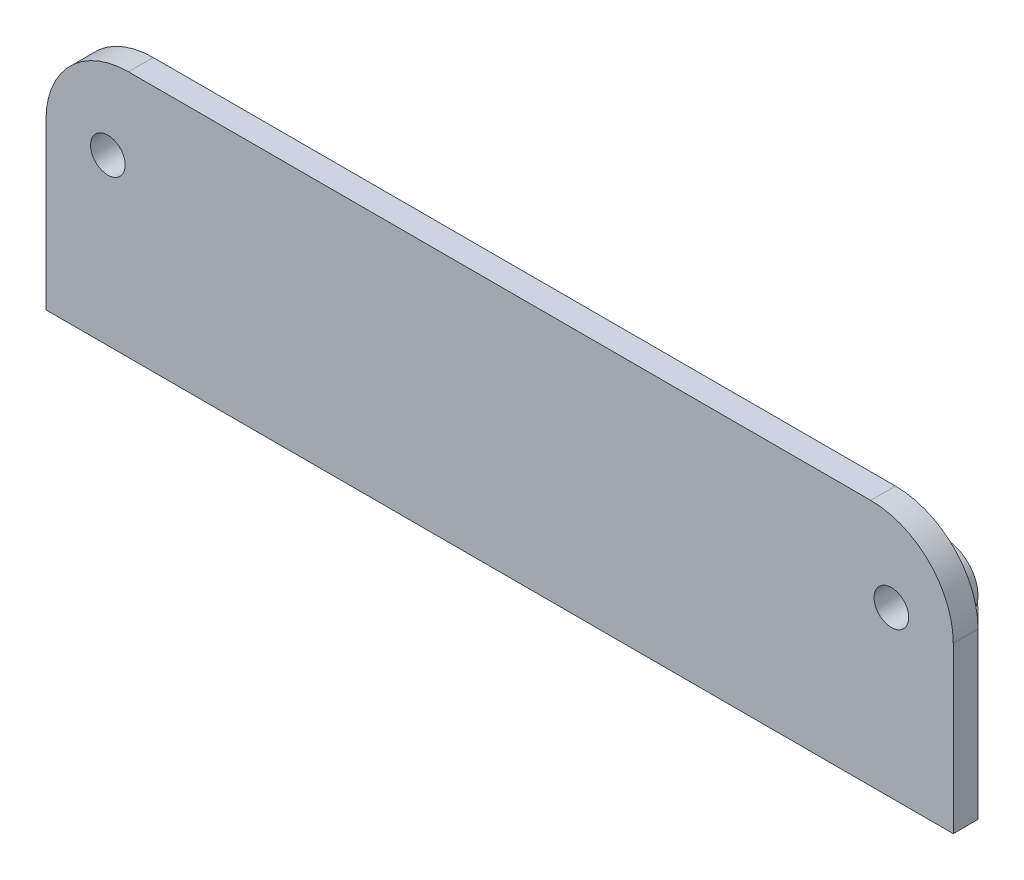
ISO-10303-21;
HEADER;
FILE_DESCRIPTION(('STEP AP214'),'2;1');
FILE_NAME('part.step','',(''),(''),'','','');
FILE_SCHEMA(('AUTOMOTIVE_DESIGN { 1 0 10303 214 1 1 1 1 }'));
ENDSEC;
DATA;
#1=APPLICATION_CONTEXT('core data for automotive mechanical design processes');
#2=APPLICATION_PROTOCOL_DEFINITION('international standard','automotive_design',2000,#1);
#3=PRODUCT_CONTEXT('',#1,'mechanical');
#4=PRODUCT('Part','Part','',(#3));
#5=PRODUCT_RELATED_PRODUCT_CATEGORY('part','',(#4));
#6=PRODUCT_DEFINITION_FORMATION('','',#4);
#7=PRODUCT_DEFINITION_CONTEXT('part definition',#1,'design');
#8=PRODUCT_DEFINITION('design','',#6,#7);
#9=PRODUCT_DEFINITION_SHAPE('','',#8);
#10=(LENGTH_UNIT() NAMED_UNIT(*) SI_UNIT(.MILLI.,.METRE.));
#11=(NAMED_UNIT(*) PLANE_ANGLE_UNIT() SI_UNIT($,.RADIAN.));
#12=(NAMED_UNIT(*) SI_UNIT($,.STERADIAN.) SOLID_ANGLE_UNIT());
#13=UNCERTAINTY_MEASURE_WITH_UNIT(LENGTH_MEASURE(1.E-05),#10,'distance_accuracy_value','');
#14=(GEOMETRIC_REPRESENTATION_CONTEXT(3) GLOBAL_UNCERTAINTY_ASSIGNED_CONTEXT((#13)) GLOBAL_UNIT_ASSIGNED_CONTEXT((#10,
#11,#12)) REPRESENTATION_CONTEXT('',''));
#15=CARTESIAN_POINT('',(0.,0.,0.));
#16=DIRECTION('',(0.,0.,1.));
#17=DIRECTION('',(1.,0.,0.));
#18=AXIS2_PLACEMENT_3D('',#15,#16,#17);
#19=CARTESIAN_POINT('',(0.,0.,15.));
#20=DIRECTION('',(0.,0.,-1.));
#21=DIRECTION('',(-1.,0.,0.));
#22=AXIS2_PLACEMENT_3D('',#19,#20,#21);
#23=PLANE('',#22);
#24=DIRECTION('',(-1.,0.,0.));
#25=VECTOR('',#24,1.);
#26=CARTESIAN_POINT('',(-55.,30.,15.));
#27=LINE('',#26,#25);
#28=CARTESIAN_POINT('',(-38.,30.,15.));
#29=VERTEX_POINT('',#28);
#30=CARTESIAN_POINT('',(-45.,30.,15.));
#31=VERTEX_POINT('',#30);
#32=EDGE_CURVE('E274',#29,#31,#27,.T.);
#33=ORIENTED_EDGE('',*,*,#32,.F.);
#34=DIRECTION('',(0.,-1.,0.));
#35=VECTOR('',#34,1.);
#36=CARTESIAN_POINT('',(-38.,5.,15.));
#37=LINE('',#36,#35);
#38=CARTESIAN_POINT('',(-38.,5.,15.));
#39=VERTEX_POINT('',#38);
#40=EDGE_CURVE('E400',#29,#39,#37,.T.);
#41=ORIENTED_EDGE('',*,*,#40,.T.);
#42=DIRECTION('',(1.,0.,0.));
#43=VECTOR('',#42,1.);
#44=CARTESIAN_POINT('',(55.,5.,15.));
#45=LINE('',#44,#43);
#46=CARTESIAN_POINT('',(-55.,5.,15.));
#47=VERTEX_POINT('',#46);
#48=EDGE_CURVE('E282',#47,#39,#45,.T.);
#49=ORIENTED_EDGE('',*,*,#48,.F.);
#50=DIRECTION('',(0.,-1.,0.));
#51=VECTOR('',#50,1.);
#52=CARTESIAN_POINT('',(-55.,0.,15.));
#53=LINE('',#52,#51);
#54=CARTESIAN_POINT('',(-55.,20.,15.));
#55=VERTEX_POINT('',#54);
#56=EDGE_CURVE('E254',#55,#47,#53,.T.);
#57=ORIENTED_EDGE('',*,*,#56,.F.);
#58=CARTESIAN_POINT('',(-45.,20.,15.));
#59=DIRECTION('',(0.,0.,-1.));
#60=DIRECTION('',(-1.,0.,0.));
#61=AXIS2_PLACEMENT_3D('',#58,#59,#60);
#62=CIRCLE('',#61,10.);
#63=EDGE_CURVE('E295',#55,#31,#62,.T.);
#64=ORIENTED_EDGE('',*,*,#63,.T.);
#65=EDGE_LOOP('',(#33,#41,#49,#57,#64));
#66=FACE_BOUND('',#65,.T.);
#67=CARTESIAN_POINT('',(-47.5,20.,15.));
#68=DIRECTION('',(0.,0.,-1.));
#69=DIRECTION('',(1.,0.,0.));
#70=AXIS2_PLACEMENT_3D('',#67,#68,#69);
#71=CIRCLE('',#70,4.00000000000001);
#72=CARTESIAN_POINT('',(-43.5,20.,15.));
#73=VERTEX_POINT('',#72);
#74=EDGE_CURVE('E457',#73,#73,#71,.T.);
#75=ORIENTED_EDGE('',*,*,#74,.F.);
#76=EDGE_LOOP('',(#75));
#77=FACE_BOUND('',#76,.T.);
#78=ADVANCED_FACE('F36',(#66,#77),#23,.T.);
#79=DIRECTION('',(0.,-1.,0.));
#80=VECTOR('',#79,1.);
#81=CARTESIAN_POINT('',(38.,5.,15.));
#82=LINE('',#81,#80);
#83=CARTESIAN_POINT('',(38.,30.,15.));
#84=VERTEX_POINT('',#83);
#85=CARTESIAN_POINT('',(38.,5.,15.));
#86=VERTEX_POINT('',#85);
#87=EDGE_CURVE('E246',#84,#86,#82,.T.);
#88=ORIENTED_EDGE('',*,*,#87,.F.);
#89=CARTESIAN_POINT('',(45.,30.,15.));
#90=VERTEX_POINT('',#89);
#91=EDGE_CURVE('E259',#90,#84,#27,.T.);
#92=ORIENTED_EDGE('',*,*,#91,.F.);
#93=CARTESIAN_POINT('',(45.,20.,15.));
#94=DIRECTION('',(0.,0.,-1.));
#95=DIRECTION('',(-1.,0.,0.));
#96=AXIS2_PLACEMENT_3D('',#93,#94,#95);
#97=CIRCLE('',#96,10.);
#98=CARTESIAN_POINT('',(55.,20.,15.));
#99=VERTEX_POINT('',#98);
#100=EDGE_CURVE('E293',#90,#99,#97,.T.);
#101=ORIENTED_EDGE('',*,*,#100,.T.);
#102=DIRECTION('',(0.,1.,0.));
#103=VECTOR('',#102,1.);
#104=CARTESIAN_POINT('',(55.,0.,15.));
#105=LINE('',#104,#103);
#106=CARTESIAN_POINT('',(55.,5.,15.));
#107=VERTEX_POINT('',#106);
#108=EDGE_CURVE('E271',#107,#99,#105,.T.);
#109=ORIENTED_EDGE('',*,*,#108,.F.);
#110=EDGE_CURVE('E286',#86,#107,#45,.T.);
#111=ORIENTED_EDGE('',*,*,#110,.F.);
#112=EDGE_LOOP('',(#88,#92,#101,#109,#111));
#113=FACE_BOUND('',#112,.T.);
#114=CARTESIAN_POINT('',(47.5,20.,15.));
#115=DIRECTION('',(0.,0.,-1.));
#116=DIRECTION('',(-1.,0.,0.));
#117=AXIS2_PLACEMENT_3D('',#114,#115,#116);
#118=CIRCLE('',#117,4.00000000000001);
#119=CARTESIAN_POINT('',(43.5,20.,15.));
#120=VERTEX_POINT('',#119);
#121=EDGE_CURVE('E448',#120,#120,#118,.T.);
#122=ORIENTED_EDGE('',*,*,#121,.F.);
#123=EDGE_LOOP('',(#122));
#124=FACE_BOUND('',#123,.T.);
#125=ADVANCED_FACE('F474',(#113,#124),#23,.T.);
#126=CARTESIAN_POINT('',(-38.,30.,15.));
#127=DIRECTION('',(0.,0.514495755427527,-0.857492925712544));
#128=DIRECTION('',(0.,0.857492925712544,0.514495755427527));
#129=AXIS2_PLACEMENT_3D('',#126,#127,#128);
#130=PLANE('',#129);
#131=DIRECTION('',(1.,0.,0.));
#132=VECTOR('',#131,1.);
#133=CARTESIAN_POINT('',(-38.,30.,15.));
#134=LINE('',#133,#132);
#135=CARTESIAN_POINT('',(6.,30.,15.));
#136=VERTEX_POINT('',#135);
#137=CARTESIAN_POINT('',(14.,30.,15.));
#138=VERTEX_POINT('',#137);
#139=EDGE_CURVE('E220',#136,#138,#134,.T.);
#140=ORIENTED_EDGE('',*,*,#139,.T.);
#141=DIRECTION('',(0.,-0.857492925712544,-0.514495755427527));
#142=VECTOR('',#141,1.);
#143=CARTESIAN_POINT('',(14.,30.,15.));
#144=LINE('',#143,#142);
#145=CARTESIAN_POINT('',(14.,5.,0.));
#146=VERTEX_POINT('',#145);
#147=EDGE_CURVE('E191',#138,#146,#144,.T.);
#148=ORIENTED_EDGE('',*,*,#147,.T.);
#149=DIRECTION('',(1.,0.,0.));
#150=VECTOR('',#149,1.);
#151=CARTESIAN_POINT('',(-38.,5.,0.));
#152=LINE('',#151,#150);
#153=CARTESIAN_POINT('',(6.,5.,0.));
#154=VERTEX_POINT('',#153);
#155=EDGE_CURVE('E486',#154,#146,#152,.T.);
#156=ORIENTED_EDGE('',*,*,#155,.F.);
#157=DIRECTION('',(0.,0.857492925712544,0.514495755427527));
#158=VECTOR('',#157,1.);
#159=CARTESIAN_POINT('',(6.,30.,15.));
#160=LINE('',#159,#158);
#161=EDGE_CURVE('E227',#154,#136,#160,.T.);
#162=ORIENTED_EDGE('',*,*,#161,.T.);
#163=EDGE_LOOP('',(#140,#148,#156,#162));
#164=FACE_BOUND('',#163,.T.);
#165=ADVANCED_FACE('F225',(#164),#130,.T.);
#166=CARTESIAN_POINT('',(26.,5.,0.));
#167=VERTEX_POINT('',#166);
#168=CARTESIAN_POINT('',(38.,5.,0.));
#169=VERTEX_POINT('',#168);
#170=EDGE_CURVE('E242',#167,#169,#152,.T.);
#171=ORIENTED_EDGE('',*,*,#170,.F.);
#172=DIRECTION('',(0.,0.857492925712544,0.514495755427527));
#173=VECTOR('',#172,1.);
#174=CARTESIAN_POINT('',(26.,30.,15.));
#175=LINE('',#174,#173);
#176=CARTESIAN_POINT('',(26.,30.,15.));
#177=VERTEX_POINT('',#176);
#178=EDGE_CURVE('E202',#167,#177,#175,.T.);
#179=ORIENTED_EDGE('',*,*,#178,.T.);
#180=EDGE_CURVE('E221',#177,#84,#134,.T.);
#181=ORIENTED_EDGE('',*,*,#180,.T.);
#182=DIRECTION('',(0.,0.857492925712544,0.514495755427527));
#183=VECTOR('',#182,1.);
#184=CARTESIAN_POINT('',(38.,30.,15.));
#185=LINE('',#184,#183);
#186=EDGE_CURVE('E405',#169,#84,#185,.T.);
#187=ORIENTED_EDGE('',*,*,#186,.F.);
#188=EDGE_LOOP('',(#171,#179,#181,#187));
#189=FACE_BOUND('',#188,.T.);
#190=ADVANCED_FACE('F481',(#189),#130,.T.);
#191=CARTESIAN_POINT('',(-14.,30.,15.));
#192=VERTEX_POINT('',#191);
#193=CARTESIAN_POINT('',(-6.,30.,15.));
#194=VERTEX_POINT('',#193);
#195=EDGE_CURVE('E228',#192,#194,#134,.T.);
#196=ORIENTED_EDGE('',*,*,#195,.T.);
#197=DIRECTION('',(0.,-0.857492925712544,-0.514495755427527));
#198=VECTOR('',#197,1.);
#199=CARTESIAN_POINT('',(-6.,30.,15.));
#200=LINE('',#199,#198);
#201=CARTESIAN_POINT('',(-6.,5.,0.));
#202=VERTEX_POINT('',#201);
#203=EDGE_CURVE('E331',#194,#202,#200,.T.);
#204=ORIENTED_EDGE('',*,*,#203,.T.);
#205=CARTESIAN_POINT('',(-14.,5.,0.));
#206=VERTEX_POINT('',#205);
#207=EDGE_CURVE('E241',#206,#202,#152,.T.);
#208=ORIENTED_EDGE('',*,*,#207,.F.);
#209=DIRECTION('',(0.,0.857492925712544,0.514495755427527));
#210=VECTOR('',#209,1.);
#211=CARTESIAN_POINT('',(-14.,30.,15.));
#212=LINE('',#211,#210);
#213=EDGE_CURVE('E324',#206,#192,#212,.T.);
#214=ORIENTED_EDGE('',*,*,#213,.T.);
#215=EDGE_LOOP('',(#196,#204,#208,#214));
#216=FACE_BOUND('',#215,.T.);
#217=ADVANCED_FACE('F493',(#216),#130,.T.);
#218=CARTESIAN_POINT('',(-26.,30.,15.));
#219=VERTEX_POINT('',#218);
#220=EDGE_CURVE('E231',#29,#219,#134,.T.);
#221=ORIENTED_EDGE('',*,*,#220,.T.);
#222=DIRECTION('',(0.,-0.857492925712544,-0.514495755427527));
#223=VECTOR('',#222,1.);
#224=CARTESIAN_POINT('',(-26.,30.,15.));
#225=LINE('',#224,#223);
#226=CARTESIAN_POINT('',(-26.,5.,0.));
#227=VERTEX_POINT('',#226);
#228=EDGE_CURVE('E327',#219,#227,#225,.T.);
#229=ORIENTED_EDGE('',*,*,#228,.T.);
#230=CARTESIAN_POINT('',(-38.,5.,0.));
#231=VERTEX_POINT('',#230);
#232=EDGE_CURVE('E232',#231,#227,#152,.T.);
#233=ORIENTED_EDGE('',*,*,#232,.F.);
#234=DIRECTION('',(0.,0.857492925712544,0.514495755427527));
#235=VECTOR('',#234,1.);
#236=CARTESIAN_POINT('',(-38.,30.,15.));
#237=LINE('',#236,#235);
#238=EDGE_CURVE('E237',#231,#29,#237,.T.);
#239=ORIENTED_EDGE('',*,*,#238,.T.);
#240=EDGE_LOOP('',(#221,#229,#233,#239));
#241=FACE_BOUND('',#240,.T.);
#242=ADVANCED_FACE('F506',(#241),#130,.T.);
#243=CARTESIAN_POINT('',(0.,5.,0.));
#244=DIRECTION('',(0.,1.,0.));
#245=DIRECTION('',(0.,0.,1.));
#246=AXIS2_PLACEMENT_3D('',#243,#244,#245);
#247=PLANE('',#246);
#248=DIRECTION('',(1.,0.,0.));
#249=VECTOR('',#248,1.);
#250=CARTESIAN_POINT('',(57.284508289482,5.,-5.00000000000001));
#251=LINE('',#250,#249);
#252=CARTESIAN_POINT('',(-30.857864376269,5.,-5.));
#253=VERTEX_POINT('',#252);
#254=CARTESIAN_POINT('',(30.857864376269,5.,-5.00000000000001));
#255=VERTEX_POINT('',#254);
#256=EDGE_CURVE('E360',#253,#255,#251,.T.);
#257=ORIENTED_EDGE('',*,*,#256,.F.);
#258=CARTESIAN_POINT('',(-30.857864376269,5.,5.));
#259=DIRECTION('',(0.,1.,0.));
#260=DIRECTION('',(0.,0.,1.));
#261=AXIS2_PLACEMENT_3D('',#258,#259,#260);
#262=CIRCLE('',#261,10.);
#263=CARTESIAN_POINT('',(-37.9289321881345,5.,-2.07106781186548));
#264=VERTEX_POINT('',#263);
#265=EDGE_CURVE('E343',#253,#264,#262,.T.);
#266=ORIENTED_EDGE('',*,*,#265,.T.);
#267=DIRECTION('',(0.707106781186549,0.,-0.707106781186546));
#268=VECTOR('',#267,1.);
#269=CARTESIAN_POINT('',(-19.9999999999999,5.,-20.));
#270=LINE('',#269,#268);
#271=EDGE_CURVE('E319',#264,#47,#270,.F.);
#272=ORIENTED_EDGE('',*,*,#271,.T.);
#273=ORIENTED_EDGE('',*,*,#48,.T.);
#274=DIRECTION('',(0.,0.,-1.));
#275=VECTOR('',#274,1.);
#276=CARTESIAN_POINT('',(-38.,5.,0.));
#277=LINE('',#276,#275);
#278=EDGE_CURVE('E402',#39,#231,#277,.T.);
#279=ORIENTED_EDGE('',*,*,#278,.T.);
#280=ORIENTED_EDGE('',*,*,#232,.T.);
#281=DIRECTION('',(0.,0.,1.));
#282=VECTOR('',#281,1.);
#283=CARTESIAN_POINT('',(-26.,5.,0.));
#284=LINE('',#283,#282);
#285=CARTESIAN_POINT('',(-26.,5.,15.));
#286=VERTEX_POINT('',#285);
#287=EDGE_CURVE('E426',#227,#286,#284,.T.);
#288=ORIENTED_EDGE('',*,*,#287,.T.);
#289=DIRECTION('',(1.,0.,0.));
#290=VECTOR('',#289,1.);
#291=CARTESIAN_POINT('',(-14.,5.,15.));
#292=LINE('',#291,#290);
#293=CARTESIAN_POINT('',(-14.,5.,15.));
#294=VERTEX_POINT('',#293);
#295=EDGE_CURVE('E424',#286,#294,#292,.T.);
#296=ORIENTED_EDGE('',*,*,#295,.T.);
#297=DIRECTION('',(0.,0.,-1.));
#298=VECTOR('',#297,1.);
#299=CARTESIAN_POINT('',(-14.,5.,0.));
#300=LINE('',#299,#298);
#301=EDGE_CURVE('E422',#294,#206,#300,.T.);
#302=ORIENTED_EDGE('',*,*,#301,.T.);
#303=ORIENTED_EDGE('',*,*,#207,.T.);
#304=DIRECTION('',(0.,0.,1.));
#305=VECTOR('',#304,1.);
#306=CARTESIAN_POINT('',(-6.,5.,0.));
#307=LINE('',#306,#305);
#308=CARTESIAN_POINT('',(-6.,5.,15.));
#309=VERTEX_POINT('',#308);
#310=EDGE_CURVE('E417',#202,#309,#307,.T.);
#311=ORIENTED_EDGE('',*,*,#310,.T.);
#312=DIRECTION('',(1.,0.,0.));
#313=VECTOR('',#312,1.);
#314=CARTESIAN_POINT('',(-6.,5.,15.));
#315=LINE('',#314,#313);
#316=CARTESIAN_POINT('',(6.,5.,15.));
#317=VERTEX_POINT('',#316);
#318=EDGE_CURVE('E439',#309,#317,#315,.T.);
#319=ORIENTED_EDGE('',*,*,#318,.T.);
#320=DIRECTION('',(0.,0.,-1.));
#321=VECTOR('',#320,1.);
#322=CARTESIAN_POINT('',(6.,5.,0.));
#323=LINE('',#322,#321);
#324=EDGE_CURVE('E437',#317,#154,#323,.T.);
#325=ORIENTED_EDGE('',*,*,#324,.T.);
#326=ORIENTED_EDGE('',*,*,#155,.T.);
#327=DIRECTION('',(0.,0.,1.));
#328=VECTOR('',#327,1.);
#329=CARTESIAN_POINT('',(14.,5.,0.));
#330=LINE('',#329,#328);
#331=CARTESIAN_POINT('',(14.,5.,15.));
#332=VERTEX_POINT('',#331);
#333=EDGE_CURVE('E196',#146,#332,#330,.T.);
#334=ORIENTED_EDGE('',*,*,#333,.T.);
#335=DIRECTION('',(1.,0.,0.));
#336=VECTOR('',#335,1.);
#337=CARTESIAN_POINT('',(14.,5.,15.));
#338=LINE('',#337,#336);
#339=CARTESIAN_POINT('',(26.,5.,15.));
#340=VERTEX_POINT('',#339);
#341=EDGE_CURVE('E210',#332,#340,#338,.T.);
#342=ORIENTED_EDGE('',*,*,#341,.T.);
#343=DIRECTION('',(0.,0.,-1.));
#344=VECTOR('',#343,1.);
#345=CARTESIAN_POINT('',(26.,5.,0.));
#346=LINE('',#345,#344);
#347=EDGE_CURVE('E222',#340,#167,#346,.T.);
#348=ORIENTED_EDGE('',*,*,#347,.T.);
#349=ORIENTED_EDGE('',*,*,#170,.T.);
#350=DIRECTION('',(0.,0.,-1.));
#351=VECTOR('',#350,1.);
#352=CARTESIAN_POINT('',(38.,5.,0.));
#353=LINE('',#352,#351);
#354=EDGE_CURVE('E410',#86,#169,#353,.T.);
#355=ORIENTED_EDGE('',*,*,#354,.F.);
#356=ORIENTED_EDGE('',*,*,#110,.T.);
#357=DIRECTION('',(0.707106781186548,0.,0.707106781186547));
#358=VECTOR('',#357,1.);
#359=CARTESIAN_POINT('',(20.,5.,-20.));
#360=LINE('',#359,#358);
#361=CARTESIAN_POINT('',(37.9289321881345,5.,-2.07106781186548));
#362=VERTEX_POINT('',#361);
#363=EDGE_CURVE('E316',#107,#362,#360,.F.);
#364=ORIENTED_EDGE('',*,*,#363,.T.);
#365=CARTESIAN_POINT('',(30.857864376269,5.,4.99999999999999));
#366=DIRECTION('',(0.,1.,0.));
#367=DIRECTION('',(0.,0.,1.));
#368=AXIS2_PLACEMENT_3D('',#365,#366,#367);
#369=CIRCLE('',#368,10.);
#370=EDGE_CURVE('E341',#362,#255,#369,.T.);
#371=ORIENTED_EDGE('',*,*,#370,.T.);
#372=EDGE_LOOP('',(#257,#266,#272,#273,#279,#280,#288,#296,#302,#303,#311,#319,#325,#326,#334,
#342,#348,#349,#355,#356,#364,#371));
#373=FACE_BOUND('',#372,.T.);
#374=CARTESIAN_POINT('',(-20.,5.,6.));
#375=DIRECTION('',(0.,-1.,0.));
#376=DIRECTION('',(0.,0.,-1.));
#377=AXIS2_PLACEMENT_3D('',#374,#375,#376);
#378=CIRCLE('',#377,2.25);
#379=CARTESIAN_POINT('',(-20.,5.,3.75));
#380=VERTEX_POINT('',#379);
#381=EDGE_CURVE('E211',#380,#380,#378,.T.);
#382=ORIENTED_EDGE('',*,*,#381,.T.);
#383=EDGE_LOOP('',(#382));
#384=FACE_BOUND('',#383,.T.);
#385=CARTESIAN_POINT('',(20.,5.,6.));
#386=DIRECTION('',(0.,-1.,0.));
#387=DIRECTION('',(0.,0.,-1.));
#388=AXIS2_PLACEMENT_3D('',#385,#386,#387);
#389=CIRCLE('',#388,2.25);
#390=CARTESIAN_POINT('',(20.,5.,3.75));
#391=VERTEX_POINT('',#390);
#392=EDGE_CURVE('E243',#391,#391,#389,.T.);
#393=ORIENTED_EDGE('',*,*,#392,.T.);
#394=EDGE_LOOP('',(#393));
#395=FACE_BOUND('',#394,.T.);
#396=ADVANCED_FACE('F364',(#373,#384,#395),#247,.T.);
#397=CARTESIAN_POINT('',(0.,0.,0.));
#398=DIRECTION('',(0.,1.,0.));
#399=DIRECTION('',(0.,0.,1.));
#400=AXIS2_PLACEMENT_3D('',#397,#398,#399);
#401=PLANE('',#400);
#402=DIRECTION('',(-0.707106781186549,0.,0.707106781186546));
#403=VECTOR('',#402,1.);
#404=CARTESIAN_POINT('',(-55.,0.,15.));
#405=LINE('',#404,#403);
#406=CARTESIAN_POINT('',(-55.,0.,15.));
#407=VERTEX_POINT('',#406);
#408=CARTESIAN_POINT('',(-37.9289321881345,0.,-2.07106781186548));
#409=VERTEX_POINT('',#408);
#410=EDGE_CURVE('E314',#407,#409,#405,.F.);
#411=ORIENTED_EDGE('',*,*,#410,.T.);
#412=CARTESIAN_POINT('',(-30.857864376269,0.,5.));
#413=DIRECTION('',(0.,1.,0.));
#414=DIRECTION('',(0.,0.,1.));
#415=AXIS2_PLACEMENT_3D('',#412,#413,#414);
#416=CIRCLE('',#415,10.);
#417=CARTESIAN_POINT('',(-30.857864376269,0.,-5.));
#418=VERTEX_POINT('',#417);
#419=EDGE_CURVE('E44',#409,#418,#416,.F.);
#420=ORIENTED_EDGE('',*,*,#419,.T.);
#421=DIRECTION('',(1.,0.,0.));
#422=VECTOR('',#421,1.);
#423=CARTESIAN_POINT('',(57.284508289482,0.,-5.00000000000001));
#424=LINE('',#423,#422);
#425=CARTESIAN_POINT('',(30.857864376269,0.,-5.00000000000001));
#426=VERTEX_POINT('',#425);
#427=EDGE_CURVE('E350',#418,#426,#424,.T.);
#428=ORIENTED_EDGE('',*,*,#427,.T.);
#429=CARTESIAN_POINT('',(30.857864376269,0.,4.99999999999999));
#430=DIRECTION('',(0.,1.,0.));
#431=DIRECTION('',(0.,0.,1.));
#432=AXIS2_PLACEMENT_3D('',#429,#430,#431);
#433=CIRCLE('',#432,10.);
#434=CARTESIAN_POINT('',(37.9289321881345,0.,-2.07106781186548));
#435=VERTEX_POINT('',#434);
#436=EDGE_CURVE('E51',#426,#435,#433,.F.);
#437=ORIENTED_EDGE('',*,*,#436,.T.);
#438=DIRECTION('',(-0.707106781186548,0.,-0.707106781186547));
#439=VECTOR('',#438,1.);
#440=CARTESIAN_POINT('',(25.,0.,-15.));
#441=LINE('',#440,#439);
#442=CARTESIAN_POINT('',(55.,0.,15.));
#443=VERTEX_POINT('',#442);
#444=EDGE_CURVE('E312',#435,#443,#441,.F.);
#445=ORIENTED_EDGE('',*,*,#444,.T.);
#446=DIRECTION('',(0.,0.,-1.));
#447=VECTOR('',#446,1.);
#448=CARTESIAN_POINT('',(55.,0.,15.));
#449=LINE('',#448,#447);
#450=CARTESIAN_POINT('',(55.,0.,18.));
#451=VERTEX_POINT('',#450);
#452=EDGE_CURVE('E288',#451,#443,#449,.T.);
#453=ORIENTED_EDGE('',*,*,#452,.F.);
#454=DIRECTION('',(1.,0.,0.));
#455=VECTOR('',#454,1.);
#456=CARTESIAN_POINT('',(-55.,0.,18.));
#457=LINE('',#456,#455);
#458=CARTESIAN_POINT('',(-55.,0.,18.));
#459=VERTEX_POINT('',#458);
#460=EDGE_CURVE('E258',#459,#451,#457,.T.);
#461=ORIENTED_EDGE('',*,*,#460,.F.);
#462=DIRECTION('',(0.,0.,1.));
#463=VECTOR('',#462,1.);
#464=CARTESIAN_POINT('',(-55.,0.,15.));
#465=LINE('',#464,#463);
#466=EDGE_CURVE('E281',#407,#459,#465,.T.);
#467=ORIENTED_EDGE('',*,*,#466,.F.);
#468=EDGE_LOOP('',(#411,#420,#428,#437,#445,#453,#461,#467));
#469=FACE_BOUND('',#468,.T.);
#470=CARTESIAN_POINT('',(-20.,0.,6.));
#471=DIRECTION('',(0.,1.,0.));
#472=DIRECTION('',(0.,0.,1.));
#473=AXIS2_PLACEMENT_3D('',#470,#471,#472);
#474=CIRCLE('',#473,2.25);
#475=CARTESIAN_POINT('',(-20.,0.,8.25000000000001));
#476=VERTEX_POINT('',#475);
#477=EDGE_CURVE('E278',#476,#476,#474,.T.);
#478=ORIENTED_EDGE('',*,*,#477,.T.);
#479=EDGE_LOOP('',(#478));
#480=FACE_BOUND('',#479,.T.);
#481=CARTESIAN_POINT('',(20.,0.,6.));
#482=DIRECTION('',(0.,1.,0.));
#483=DIRECTION('',(0.,0.,-1.));
#484=AXIS2_PLACEMENT_3D('',#481,#482,#483);
#485=CIRCLE('',#484,2.25);
#486=CARTESIAN_POINT('',(20.,0.,3.75));
#487=VERTEX_POINT('',#486);
#488=EDGE_CURVE('E268',#487,#487,#485,.T.);
#489=ORIENTED_EDGE('',*,*,#488,.T.);
#490=EDGE_LOOP('',(#489));
#491=FACE_BOUND('',#490,.T.);
#492=ADVANCED_FACE('F348',(#469,#480,#491),#401,.F.);
#493=CARTESIAN_POINT('',(-55.,5.,15.));
#494=DIRECTION('',(1.,0.,0.));
#495=DIRECTION('',(0.,0.,-1.));
#496=AXIS2_PLACEMENT_3D('',#493,#494,#495);
#497=PLANE('',#496);
#498=ORIENTED_EDGE('',*,*,#56,.T.);
#499=DIRECTION('',(0.,-1.,0.));
#500=VECTOR('',#499,1.);
#501=CARTESIAN_POINT('',(-55.,5.,15.));
#502=LINE('',#501,#500);
#503=EDGE_CURVE('E309',#47,#407,#502,.T.);
#504=ORIENTED_EDGE('',*,*,#503,.T.);
#505=ORIENTED_EDGE('',*,*,#466,.T.);
#506=DIRECTION('',(0.,-1.,0.));
#507=VECTOR('',#506,1.);
#508=CARTESIAN_POINT('',(-55.,0.,18.));
#509=LINE('',#508,#507);
#510=CARTESIAN_POINT('',(-55.,20.,18.));
#511=VERTEX_POINT('',#510);
#512=EDGE_CURVE('E255',#511,#459,#509,.T.);
#513=ORIENTED_EDGE('',*,*,#512,.F.);
#514=DIRECTION('',(0.,0.,-1.));
#515=VECTOR('',#514,1.);
#516=CARTESIAN_POINT('',(-55.,20.,15.));
#517=LINE('',#516,#515);
#518=EDGE_CURVE('E285',#511,#55,#517,.T.);
#519=ORIENTED_EDGE('',*,*,#518,.T.);
#520=EDGE_LOOP('',(#498,#504,#505,#513,#519));
#521=FACE_BOUND('',#520,.T.);
#522=ADVANCED_FACE('F369',(#521),#497,.F.);
#523=CARTESIAN_POINT('',(55.,5.,15.));
#524=DIRECTION('',(-1.,0.,0.));
#525=DIRECTION('',(0.,0.,1.));
#526=AXIS2_PLACEMENT_3D('',#523,#524,#525);
#527=PLANE('',#526);
#528=ORIENTED_EDGE('',*,*,#452,.T.);
#529=DIRECTION('',(0.,1.,0.));
#530=VECTOR('',#529,1.);
#531=CARTESIAN_POINT('',(55.,5.,15.));
#532=LINE('',#531,#530);
#533=EDGE_CURVE('E321',#443,#107,#532,.T.);
#534=ORIENTED_EDGE('',*,*,#533,.T.);
#535=ORIENTED_EDGE('',*,*,#108,.T.);
#536=DIRECTION('',(0.,0.,-1.));
#537=VECTOR('',#536,1.);
#538=CARTESIAN_POINT('',(55.,20.,15.));
#539=LINE('',#538,#537);
#540=CARTESIAN_POINT('',(55.,20.,18.));
#541=VERTEX_POINT('',#540);
#542=EDGE_CURVE('E307',#99,#541,#539,.F.);
#543=ORIENTED_EDGE('',*,*,#542,.T.);
#544=DIRECTION('',(0.,1.,0.));
#545=VECTOR('',#544,1.);
#546=CARTESIAN_POINT('',(55.,0.,18.));
#547=LINE('',#546,#545);
#548=EDGE_CURVE('E262',#451,#541,#547,.T.);
#549=ORIENTED_EDGE('',*,*,#548,.F.);
#550=EDGE_LOOP('',(#528,#534,#535,#543,#549));
#551=FACE_BOUND('',#550,.T.);
#552=ADVANCED_FACE('F380',(#551),#527,.F.);
#553=CARTESIAN_POINT('',(-20.,5.,6.));
#554=DIRECTION('',(0.,-1.,0.));
#555=DIRECTION('',(0.,0.,-1.));
#556=AXIS2_PLACEMENT_3D('',#553,#554,#555);
#557=CYLINDRICAL_SURFACE('',#556,2.25);
#558=ORIENTED_EDGE('',*,*,#381,.F.);
#559=EDGE_LOOP('',(#558));
#560=FACE_BOUND('',#559,.T.);
#561=ORIENTED_EDGE('',*,*,#477,.F.);
#562=EDGE_LOOP('',(#561));
#563=FACE_BOUND('',#562,.T.);
#564=ADVANCED_FACE('F534',(#560,#563),#557,.F.);
#565=CARTESIAN_POINT('',(20.,5.,6.));
#566=DIRECTION('',(0.,-1.,0.));
#567=DIRECTION('',(0.,0.,-1.));
#568=AXIS2_PLACEMENT_3D('',#565,#566,#567);
#569=CYLINDRICAL_SURFACE('',#568,2.25);
#570=ORIENTED_EDGE('',*,*,#392,.F.);
#571=EDGE_LOOP('',(#570));
#572=FACE_BOUND('',#571,.T.);
#573=ORIENTED_EDGE('',*,*,#488,.F.);
#574=EDGE_LOOP('',(#573));
#575=FACE_BOUND('',#574,.T.);
#576=ADVANCED_FACE('F531',(#572,#575),#569,.F.);
#577=CARTESIAN_POINT('',(0.,0.,18.));
#578=DIRECTION('',(0.,0.,-1.));
#579=DIRECTION('',(-1.,0.,0.));
#580=AXIS2_PLACEMENT_3D('',#577,#578,#579);
#581=PLANE('',#580);
#582=DIRECTION('',(-1.,0.,0.));
#583=VECTOR('',#582,1.);
#584=CARTESIAN_POINT('',(-55.,30.,18.));
#585=LINE('',#584,#583);
#586=CARTESIAN_POINT('',(45.,30.,18.));
#587=VERTEX_POINT('',#586);
#588=CARTESIAN_POINT('',(-45.,30.,18.));
#589=VERTEX_POINT('',#588);
#590=EDGE_CURVE('E265',#587,#589,#585,.T.);
#591=ORIENTED_EDGE('',*,*,#590,.T.);
#592=CARTESIAN_POINT('',(-45.,20.,18.));
#593=DIRECTION('',(0.,0.,-1.));
#594=DIRECTION('',(-1.,0.,0.));
#595=AXIS2_PLACEMENT_3D('',#592,#593,#594);
#596=CIRCLE('',#595,10.);
#597=EDGE_CURVE('E305',#589,#511,#596,.F.);
#598=ORIENTED_EDGE('',*,*,#597,.T.);
#599=ORIENTED_EDGE('',*,*,#512,.T.);
#600=ORIENTED_EDGE('',*,*,#460,.T.);
#601=ORIENTED_EDGE('',*,*,#548,.T.);
#602=CARTESIAN_POINT('',(45.,20.,18.));
#603=DIRECTION('',(0.,0.,-1.));
#604=DIRECTION('',(-1.,0.,0.));
#605=AXIS2_PLACEMENT_3D('',#602,#603,#604);
#606=CIRCLE('',#605,10.);
#607=EDGE_CURVE('E303',#541,#587,#606,.F.);
#608=ORIENTED_EDGE('',*,*,#607,.T.);
#609=EDGE_LOOP('',(#591,#598,#599,#600,#601,#608));
#610=FACE_BOUND('',#609,.T.);
#611=CARTESIAN_POINT('',(-47.5,20.,18.));
#612=DIRECTION('',(0.,0.,1.));
#613=DIRECTION('',(1.,0.,0.));
#614=AXIS2_PLACEMENT_3D('',#611,#612,#613);
#615=CIRCLE('',#614,2.1);
#616=CARTESIAN_POINT('',(-45.4,20.,18.));
#617=VERTEX_POINT('',#616);
#618=EDGE_CURVE('E251',#617,#617,#615,.T.);
#619=ORIENTED_EDGE('',*,*,#618,.F.);
#620=EDGE_LOOP('',(#619));
#621=FACE_BOUND('',#620,.T.);
#622=CARTESIAN_POINT('',(47.5,20.,18.));
#623=DIRECTION('',(0.,0.,1.));
#624=DIRECTION('',(-1.,0.,0.));
#625=AXIS2_PLACEMENT_3D('',#622,#623,#624);
#626=CIRCLE('',#625,2.1);
#627=CARTESIAN_POINT('',(45.4,20.,18.));
#628=VERTEX_POINT('',#627);
#629=EDGE_CURVE('E236',#628,#628,#626,.T.);
#630=ORIENTED_EDGE('',*,*,#629,.F.);
#631=EDGE_LOOP('',(#630));
#632=FACE_BOUND('',#631,.T.);
#633=ADVANCED_FACE('F376',(#610,#621,#632),#581,.F.);
#634=CARTESIAN_POINT('',(-55.,30.,18.));
#635=DIRECTION('',(0.,-1.,0.));
#636=DIRECTION('',(0.,0.,-1.));
#637=AXIS2_PLACEMENT_3D('',#634,#635,#636);
#638=PLANE('',#637);
#639=ORIENTED_EDGE('',*,*,#91,.T.);
#640=ORIENTED_EDGE('',*,*,#180,.F.);
#641=DIRECTION('',(1.,0.,0.));
#642=VECTOR('',#641,1.);
#643=CARTESIAN_POINT('',(14.,30.,15.));
#644=LINE('',#643,#642);
#645=EDGE_CURVE('E208',#138,#177,#644,.T.);
#646=ORIENTED_EDGE('',*,*,#645,.F.);
#647=ORIENTED_EDGE('',*,*,#139,.F.);
#648=DIRECTION('',(1.,0.,0.));
#649=VECTOR('',#648,1.);
#650=CARTESIAN_POINT('',(-6.,30.,15.));
#651=LINE('',#650,#649);
#652=EDGE_CURVE('E436',#194,#136,#651,.T.);
#653=ORIENTED_EDGE('',*,*,#652,.F.);
#654=ORIENTED_EDGE('',*,*,#195,.F.);
#655=DIRECTION('',(1.,0.,0.));
#656=VECTOR('',#655,1.);
#657=CARTESIAN_POINT('',(-14.,30.,15.));
#658=LINE('',#657,#656);
#659=EDGE_CURVE('E421',#219,#192,#658,.T.);
#660=ORIENTED_EDGE('',*,*,#659,.F.);
#661=ORIENTED_EDGE('',*,*,#220,.F.);
#662=ORIENTED_EDGE('',*,*,#32,.T.);
#663=DIRECTION('',(0.,0.,-1.));
#664=VECTOR('',#663,1.);
#665=CARTESIAN_POINT('',(-45.,30.,18.));
#666=LINE('',#665,#664);
#667=EDGE_CURVE('E301',#31,#589,#666,.F.);
#668=ORIENTED_EDGE('',*,*,#667,.T.);
#669=ORIENTED_EDGE('',*,*,#590,.F.);
#670=DIRECTION('',(0.,0.,-1.));
#671=VECTOR('',#670,1.);
#672=CARTESIAN_POINT('',(45.,30.,18.));
#673=LINE('',#672,#671);
#674=EDGE_CURVE('E298',#587,#90,#673,.T.);
#675=ORIENTED_EDGE('',*,*,#674,.T.);
#676=EDGE_LOOP('',(#639,#640,#646,#647,#653,#654,#660,#661,#662,#668,#669,#675));
#677=FACE_BOUND('',#676,.T.);
#678=ADVANCED_FACE('F218',(#677),#638,.F.);
#679=CARTESIAN_POINT('',(-47.5,20.,18.));
#680=DIRECTION('',(0.,0.,-1.));
#681=DIRECTION('',(-1.,0.,0.));
#682=AXIS2_PLACEMENT_3D('',#679,#680,#681);
#683=CYLINDRICAL_SURFACE('',#682,2.1);
#684=ORIENTED_EDGE('',*,*,#618,.T.);
#685=EDGE_LOOP('',(#684));
#686=FACE_BOUND('',#685,.T.);
#687=CARTESIAN_POINT('',(-47.5,20.,11.5));
#688=DIRECTION('',(0.,0.,-1.));
#689=DIRECTION('',(1.,0.,0.));
#690=AXIS2_PLACEMENT_3D('',#687,#688,#689);
#691=CIRCLE('',#690,2.1);
#692=CARTESIAN_POINT('',(-45.4,20.,11.5));
#693=VERTEX_POINT('',#692);
#694=EDGE_CURVE('E359',#693,#693,#691,.T.);
#695=ORIENTED_EDGE('',*,*,#694,.T.);
#696=EDGE_LOOP('',(#695));
#697=FACE_BOUND('',#696,.T.);
#698=ADVANCED_FACE('F530',(#686,#697),#683,.F.);
#699=CARTESIAN_POINT('',(47.5,20.,18.));
#700=DIRECTION('',(0.,0.,-1.));
#701=DIRECTION('',(-1.,0.,0.));
#702=AXIS2_PLACEMENT_3D('',#699,#700,#701);
#703=CYLINDRICAL_SURFACE('',#702,2.1);
#704=ORIENTED_EDGE('',*,*,#629,.T.);
#705=EDGE_LOOP('',(#704));
#706=FACE_BOUND('',#705,.T.);
#707=CARTESIAN_POINT('',(47.5,20.,11.5));
#708=DIRECTION('',(0.,0.,-1.));
#709=DIRECTION('',(-1.,0.,0.));
#710=AXIS2_PLACEMENT_3D('',#707,#708,#709);
#711=CIRCLE('',#710,2.1);
#712=CARTESIAN_POINT('',(45.4,20.,11.5));
#713=VERTEX_POINT('',#712);
#714=EDGE_CURVE('E451',#713,#713,#711,.T.);
#715=ORIENTED_EDGE('',*,*,#714,.T.);
#716=EDGE_LOOP('',(#715));
#717=FACE_BOUND('',#716,.T.);
#718=ADVANCED_FACE('F549',(#706,#717),#703,.F.);
#719=CARTESIAN_POINT('',(-45.,20.,15.));
#720=DIRECTION('',(0.,0.,-1.));
#721=DIRECTION('',(-1.,0.,0.));
#722=AXIS2_PLACEMENT_3D('',#719,#720,#721);
#723=CYLINDRICAL_SURFACE('',#722,10.);
#724=ORIENTED_EDGE('',*,*,#597,.F.);
#725=ORIENTED_EDGE('',*,*,#667,.F.);
#726=ORIENTED_EDGE('',*,*,#63,.F.);
#727=ORIENTED_EDGE('',*,*,#518,.F.);
#728=EDGE_LOOP('',(#724,#725,#726,#727));
#729=FACE_BOUND('',#728,.T.);
#730=ADVANCED_FACE('F394',(#729),#723,.T.);
#731=CARTESIAN_POINT('',(45.,20.,18.));
#732=DIRECTION('',(0.,0.,-1.));
#733=DIRECTION('',(-1.,0.,0.));
#734=AXIS2_PLACEMENT_3D('',#731,#732,#733);
#735=CYLINDRICAL_SURFACE('',#734,10.);
#736=ORIENTED_EDGE('',*,*,#607,.F.);
#737=ORIENTED_EDGE('',*,*,#542,.F.);
#738=ORIENTED_EDGE('',*,*,#100,.F.);
#739=ORIENTED_EDGE('',*,*,#674,.F.);
#740=EDGE_LOOP('',(#736,#737,#738,#739));
#741=FACE_BOUND('',#740,.T.);
#742=ADVANCED_FACE('F385',(#741),#735,.T.);
#743=CARTESIAN_POINT('',(-55.,5.,15.));
#744=DIRECTION('',(0.707106781186546,0.,0.707106781186549));
#745=DIRECTION('',(0.,-1.,0.));
#746=AXIS2_PLACEMENT_3D('',#743,#744,#745);
#747=PLANE('',#746);
#748=ORIENTED_EDGE('',*,*,#271,.F.);
#749=DIRECTION('',(0.,1.,0.));
#750=VECTOR('',#749,1.);
#751=CARTESIAN_POINT('',(-37.9289321881345,0.,-2.07106781186548));
#752=LINE('',#751,#750);
#753=EDGE_CURVE('E59',#264,#409,#752,.F.);
#754=ORIENTED_EDGE('',*,*,#753,.T.);
#755=ORIENTED_EDGE('',*,*,#410,.F.);
#756=ORIENTED_EDGE('',*,*,#503,.F.);
#757=EDGE_LOOP('',(#748,#754,#755,#756));
#758=FACE_BOUND('',#757,.T.);
#759=ADVANCED_FACE('F367',(#758),#747,.F.);
#760=CARTESIAN_POINT('',(25.,5.,-15.));
#761=DIRECTION('',(-0.707106781186547,0.,0.707106781186548));
#762=DIRECTION('',(0.,-1.,0.));
#763=AXIS2_PLACEMENT_3D('',#760,#761,#762);
#764=PLANE('',#763);
#765=ORIENTED_EDGE('',*,*,#444,.F.);
#766=DIRECTION('',(0.,-1.,0.));
#767=VECTOR('',#766,1.);
#768=CARTESIAN_POINT('',(37.9289321881345,5.,-2.07106781186548));
#769=LINE('',#768,#767);
#770=EDGE_CURVE('E11',#435,#362,#769,.F.);
#771=ORIENTED_EDGE('',*,*,#770,.T.);
#772=ORIENTED_EDGE('',*,*,#363,.F.);
#773=ORIENTED_EDGE('',*,*,#533,.F.);
#774=EDGE_LOOP('',(#765,#771,#772,#773));
#775=FACE_BOUND('',#774,.T.);
#776=ADVANCED_FACE('F469',(#775),#764,.F.);
#777=CARTESIAN_POINT('',(38.,0.,0.));
#778=DIRECTION('',(1.,0.,0.));
#779=DIRECTION('',(0.,0.,-1.));
#780=AXIS2_PLACEMENT_3D('',#777,#778,#779);
#781=PLANE('',#780);
#782=ORIENTED_EDGE('',*,*,#87,.T.);
#783=ORIENTED_EDGE('',*,*,#354,.T.);
#784=ORIENTED_EDGE('',*,*,#186,.T.);
#785=EDGE_LOOP('',(#782,#783,#784));
#786=FACE_BOUND('',#785,.T.);
#787=ADVANCED_FACE('F477',(#786),#781,.T.);
#788=CARTESIAN_POINT('',(-38.,0.,0.));
#789=DIRECTION('',(1.,0.,0.));
#790=DIRECTION('',(0.,0.,-1.));
#791=AXIS2_PLACEMENT_3D('',#788,#789,#790);
#792=PLANE('',#791);
#793=ORIENTED_EDGE('',*,*,#40,.F.);
#794=ORIENTED_EDGE('',*,*,#238,.F.);
#795=ORIENTED_EDGE('',*,*,#278,.F.);
#796=EDGE_LOOP('',(#793,#794,#795));
#797=FACE_BOUND('',#796,.T.);
#798=ADVANCED_FACE('F507',(#797),#792,.F.);
#799=CARTESIAN_POINT('',(-26.,30.,0.));
#800=DIRECTION('',(1.,0.,0.));
#801=DIRECTION('',(0.,0.,-1.));
#802=AXIS2_PLACEMENT_3D('',#799,#800,#801);
#803=PLANE('',#802);
#804=DIRECTION('',(0.,-1.,0.));
#805=VECTOR('',#804,1.);
#806=CARTESIAN_POINT('',(-26.,30.,15.));
#807=LINE('',#806,#805);
#808=EDGE_CURVE('E414',#219,#286,#807,.T.);
#809=ORIENTED_EDGE('',*,*,#808,.T.);
#810=ORIENTED_EDGE('',*,*,#287,.F.);
#811=ORIENTED_EDGE('',*,*,#228,.F.);
#812=EDGE_LOOP('',(#809,#810,#811));
#813=FACE_BOUND('',#812,.T.);
#814=ADVANCED_FACE('F509',(#813),#803,.T.);
#815=CARTESIAN_POINT('',(-14.,30.,15.));
#816=DIRECTION('',(0.,0.,-1.));
#817=DIRECTION('',(-1.,0.,0.));
#818=AXIS2_PLACEMENT_3D('',#815,#816,#817);
#819=PLANE('',#818);
#820=ORIENTED_EDGE('',*,*,#295,.F.);
#821=ORIENTED_EDGE('',*,*,#808,.F.);
#822=ORIENTED_EDGE('',*,*,#659,.T.);
#823=DIRECTION('',(0.,-1.,0.));
#824=VECTOR('',#823,1.);
#825=CARTESIAN_POINT('',(-14.,30.,15.));
#826=LINE('',#825,#824);
#827=EDGE_CURVE('E418',#192,#294,#826,.T.);
#828=ORIENTED_EDGE('',*,*,#827,.T.);
#829=EDGE_LOOP('',(#820,#821,#822,#828));
#830=FACE_BOUND('',#829,.T.);
#831=ADVANCED_FACE('F515',(#830),#819,.T.);
#832=CARTESIAN_POINT('',(-14.,30.,0.));
#833=DIRECTION('',(-1.,0.,0.));
#834=DIRECTION('',(0.,0.,1.));
#835=AXIS2_PLACEMENT_3D('',#832,#833,#834);
#836=PLANE('',#835);
#837=ORIENTED_EDGE('',*,*,#301,.F.);
#838=ORIENTED_EDGE('',*,*,#827,.F.);
#839=ORIENTED_EDGE('',*,*,#213,.F.);
#840=EDGE_LOOP('',(#837,#838,#839));
#841=FACE_BOUND('',#840,.T.);
#842=ADVANCED_FACE('F600',(#841),#836,.T.);
#843=CARTESIAN_POINT('',(-6.,30.,0.));
#844=DIRECTION('',(1.,0.,0.));
#845=DIRECTION('',(0.,0.,-1.));
#846=AXIS2_PLACEMENT_3D('',#843,#844,#845);
#847=PLANE('',#846);
#848=DIRECTION('',(0.,-1.,0.));
#849=VECTOR('',#848,1.);
#850=CARTESIAN_POINT('',(-6.,30.,15.));
#851=LINE('',#850,#849);
#852=EDGE_CURVE('E430',#194,#309,#851,.T.);
#853=ORIENTED_EDGE('',*,*,#852,.T.);
#854=ORIENTED_EDGE('',*,*,#310,.F.);
#855=ORIENTED_EDGE('',*,*,#203,.F.);
#856=EDGE_LOOP('',(#853,#854,#855));
#857=FACE_BOUND('',#856,.T.);
#858=ADVANCED_FACE('F497',(#857),#847,.T.);
#859=CARTESIAN_POINT('',(-6.,30.,15.));
#860=DIRECTION('',(0.,0.,-1.));
#861=DIRECTION('',(-1.,0.,0.));
#862=AXIS2_PLACEMENT_3D('',#859,#860,#861);
#863=PLANE('',#862);
#864=ORIENTED_EDGE('',*,*,#318,.F.);
#865=ORIENTED_EDGE('',*,*,#852,.F.);
#866=ORIENTED_EDGE('',*,*,#652,.T.);
#867=DIRECTION('',(0.,-1.,0.));
#868=VECTOR('',#867,1.);
#869=CARTESIAN_POINT('',(6.,30.,15.));
#870=LINE('',#869,#868);
#871=EDGE_CURVE('E433',#136,#317,#870,.T.);
#872=ORIENTED_EDGE('',*,*,#871,.T.);
#873=EDGE_LOOP('',(#864,#865,#866,#872));
#874=FACE_BOUND('',#873,.T.);
#875=ADVANCED_FACE('F499',(#874),#863,.T.);
#876=CARTESIAN_POINT('',(6.,30.,0.));
#877=DIRECTION('',(-1.,0.,0.));
#878=DIRECTION('',(0.,0.,1.));
#879=AXIS2_PLACEMENT_3D('',#876,#877,#878);
#880=PLANE('',#879);
#881=ORIENTED_EDGE('',*,*,#324,.F.);
#882=ORIENTED_EDGE('',*,*,#871,.F.);
#883=ORIENTED_EDGE('',*,*,#161,.F.);
#884=EDGE_LOOP('',(#881,#882,#883));
#885=FACE_BOUND('',#884,.T.);
#886=ADVANCED_FACE('F592',(#885),#880,.T.);
#887=CARTESIAN_POINT('',(14.,30.,0.));
#888=DIRECTION('',(1.,0.,0.));
#889=DIRECTION('',(0.,0.,-1.));
#890=AXIS2_PLACEMENT_3D('',#887,#888,#889);
#891=PLANE('',#890);
#892=DIRECTION('',(0.,-1.,0.));
#893=VECTOR('',#892,1.);
#894=CARTESIAN_POINT('',(14.,30.,15.));
#895=LINE('',#894,#893);
#896=EDGE_CURVE('E194',#138,#332,#895,.T.);
#897=ORIENTED_EDGE('',*,*,#896,.T.);
#898=ORIENTED_EDGE('',*,*,#333,.F.);
#899=ORIENTED_EDGE('',*,*,#147,.F.);
#900=EDGE_LOOP('',(#897,#898,#899));
#901=FACE_BOUND('',#900,.T.);
#902=ADVANCED_FACE('F193',(#901),#891,.T.);
#903=CARTESIAN_POINT('',(14.,30.,15.));
#904=DIRECTION('',(0.,0.,-1.));
#905=DIRECTION('',(-1.,0.,0.));
#906=AXIS2_PLACEMENT_3D('',#903,#904,#905);
#907=PLANE('',#906);
#908=ORIENTED_EDGE('',*,*,#341,.F.);
#909=ORIENTED_EDGE('',*,*,#896,.F.);
#910=ORIENTED_EDGE('',*,*,#645,.T.);
#911=DIRECTION('',(0.,-1.,0.));
#912=VECTOR('',#911,1.);
#913=CARTESIAN_POINT('',(26.,30.,15.));
#914=LINE('',#913,#912);
#915=EDGE_CURVE('E212',#177,#340,#914,.T.);
#916=ORIENTED_EDGE('',*,*,#915,.T.);
#917=EDGE_LOOP('',(#908,#909,#910,#916));
#918=FACE_BOUND('',#917,.T.);
#919=ADVANCED_FACE('F206',(#918),#907,.T.);
#920=CARTESIAN_POINT('',(26.,30.,0.));
#921=DIRECTION('',(-1.,0.,0.));
#922=DIRECTION('',(0.,0.,1.));
#923=AXIS2_PLACEMENT_3D('',#920,#921,#922);
#924=PLANE('',#923);
#925=ORIENTED_EDGE('',*,*,#347,.F.);
#926=ORIENTED_EDGE('',*,*,#915,.F.);
#927=ORIENTED_EDGE('',*,*,#178,.F.);
#928=EDGE_LOOP('',(#925,#926,#927));
#929=FACE_BOUND('',#928,.T.);
#930=ADVANCED_FACE('F485',(#929),#924,.T.);
#931=CARTESIAN_POINT('',(47.5,20.,11.5));
#932=DIRECTION('',(0.,0.,-1.));
#933=DIRECTION('',(-1.,0.,0.));
#934=AXIS2_PLACEMENT_3D('',#931,#932,#933);
#935=PLANE('',#934);
#936=CARTESIAN_POINT('',(47.5,20.,11.5));
#937=DIRECTION('',(0.,0.,-1.));
#938=DIRECTION('',(-1.,0.,0.));
#939=AXIS2_PLACEMENT_3D('',#936,#937,#938);
#940=CIRCLE('',#939,4.00000000000001);
#941=CARTESIAN_POINT('',(43.5,20.,11.5));
#942=VERTEX_POINT('',#941);
#943=EDGE_CURVE('E428',#942,#942,#940,.T.);
#944=ORIENTED_EDGE('',*,*,#943,.T.);
#945=EDGE_LOOP('',(#944));
#946=FACE_BOUND('',#945,.T.);
#947=ORIENTED_EDGE('',*,*,#714,.F.);
#948=EDGE_LOOP('',(#947));
#949=FACE_BOUND('',#948,.T.);
#950=ADVANCED_FACE('F579',(#946,#949),#935,.T.);
#951=CARTESIAN_POINT('',(47.5,20.,11.5));
#952=DIRECTION('',(0.,0.,1.));
#953=DIRECTION('',(1.,0.,0.));
#954=AXIS2_PLACEMENT_3D('',#951,#952,#953);
#955=CYLINDRICAL_SURFACE('',#954,4.00000000000001);
#956=ORIENTED_EDGE('',*,*,#943,.F.);
#957=EDGE_LOOP('',(#956));
#958=FACE_BOUND('',#957,.T.);
#959=ORIENTED_EDGE('',*,*,#121,.T.);
#960=EDGE_LOOP('',(#959));
#961=FACE_BOUND('',#960,.T.);
#962=ADVANCED_FACE('F576',(#958,#961),#955,.T.);
#963=CARTESIAN_POINT('',(-47.5,20.,11.5));
#964=DIRECTION('',(0.,0.,1.));
#965=DIRECTION('',(1.,0.,0.));
#966=AXIS2_PLACEMENT_3D('',#963,#964,#965);
#967=PLANE('',#966);
#968=CARTESIAN_POINT('',(-47.5,20.,11.5));
#969=DIRECTION('',(0.,0.,-1.));
#970=DIRECTION('',(1.,0.,0.));
#971=AXIS2_PLACEMENT_3D('',#968,#969,#970);
#972=CIRCLE('',#971,4.00000000000001);
#973=CARTESIAN_POINT('',(-43.5,20.,11.5));
#974=VERTEX_POINT('',#973);
#975=EDGE_CURVE('E456',#974,#974,#972,.T.);
#976=ORIENTED_EDGE('',*,*,#975,.T.);
#977=EDGE_LOOP('',(#976));
#978=FACE_BOUND('',#977,.T.);
#979=ORIENTED_EDGE('',*,*,#694,.F.);
#980=EDGE_LOOP('',(#979));
#981=FACE_BOUND('',#980,.T.);
#982=ADVANCED_FACE('F571',(#978,#981),#967,.F.);
#983=CARTESIAN_POINT('',(-47.5,20.,11.5));
#984=DIRECTION('',(0.,0.,1.));
#985=DIRECTION('',(1.,0.,0.));
#986=AXIS2_PLACEMENT_3D('',#983,#984,#985);
#987=CYLINDRICAL_SURFACE('',#986,4.00000000000001);
#988=ORIENTED_EDGE('',*,*,#975,.F.);
#989=EDGE_LOOP('',(#988));
#990=FACE_BOUND('',#989,.T.);
#991=ORIENTED_EDGE('',*,*,#74,.T.);
#992=EDGE_LOOP('',(#991));
#993=FACE_BOUND('',#992,.T.);
#994=ADVANCED_FACE('F566',(#990,#993),#987,.T.);
#995=CARTESIAN_POINT('',(57.284508289482,0.,-5.00000000000001));
#996=DIRECTION('',(0.,0.,1.));
#997=DIRECTION('',(1.,0.,0.));
#998=AXIS2_PLACEMENT_3D('',#995,#996,#997);
#999=PLANE('',#998);
#1000=ORIENTED_EDGE('',*,*,#427,.F.);
#1001=DIRECTION('',(0.,-1.,0.));
#1002=VECTOR('',#1001,1.);
#1003=CARTESIAN_POINT('',(-30.857864376269,5.,-5.));
#1004=LINE('',#1003,#1002);
#1005=EDGE_CURVE('E338',#418,#253,#1004,.F.);
#1006=ORIENTED_EDGE('',*,*,#1005,.T.);
#1007=ORIENTED_EDGE('',*,*,#256,.T.);
#1008=DIRECTION('',(0.,1.,0.));
#1009=VECTOR('',#1008,1.);
#1010=CARTESIAN_POINT('',(30.857864376269,0.,-5.00000000000001));
#1011=LINE('',#1010,#1009);
#1012=EDGE_CURVE('E201',#255,#426,#1011,.F.);
#1013=ORIENTED_EDGE('',*,*,#1012,.T.);
#1014=EDGE_LOOP('',(#1000,#1006,#1007,#1013));
#1015=FACE_BOUND('',#1014,.T.);
#1016=ADVANCED_FACE('F355',(#1015),#999,.F.);
#1017=CARTESIAN_POINT('',(-30.857864376269,0.,5.));
#1018=DIRECTION('',(0.,1.,0.));
#1019=DIRECTION('',(0.,0.,1.));
#1020=AXIS2_PLACEMENT_3D('',#1017,#1018,#1019);
#1021=CYLINDRICAL_SURFACE('',#1020,10.);
#1022=ORIENTED_EDGE('',*,*,#419,.F.);
#1023=ORIENTED_EDGE('',*,*,#753,.F.);
#1024=ORIENTED_EDGE('',*,*,#265,.F.);
#1025=ORIENTED_EDGE('',*,*,#1005,.F.);
#1026=EDGE_LOOP('',(#1022,#1023,#1024,#1025));
#1027=FACE_BOUND('',#1026,.T.);
#1028=ADVANCED_FACE('F362',(#1027),#1021,.T.);
#1029=CARTESIAN_POINT('',(30.857864376269,0.,4.99999999999999));
#1030=DIRECTION('',(0.,-1.,0.));
#1031=DIRECTION('',(0.,0.,-1.));
#1032=AXIS2_PLACEMENT_3D('',#1029,#1030,#1031);
#1033=CYLINDRICAL_SURFACE('',#1032,10.);
#1034=ORIENTED_EDGE('',*,*,#370,.F.);
#1035=ORIENTED_EDGE('',*,*,#770,.F.);
#1036=ORIENTED_EDGE('',*,*,#436,.F.);
#1037=ORIENTED_EDGE('',*,*,#1012,.F.);
#1038=EDGE_LOOP('',(#1034,#1035,#1036,#1037));
#1039=FACE_BOUND('',#1038,.T.);
#1040=ADVANCED_FACE('F38',(#1039),#1033,.T.);
#1041=CLOSED_SHELL('',(#78,#125,#165,#190,#217,#242,#396,#492,#522,#552,#564,#576,#633,#678,
#698,#718,#730,#742,#759,#776,#787,#798,#814,#831,#842,#858,#875,#886,#902,#919,#930,#950,#962,
#982,#994,#1016,#1028,#1040));
#1042=MANIFOLD_SOLID_BREP('B2',#1041);
#1043=ADVANCED_BREP_SHAPE_REPRESENTATION('',(#18,#1042),#14);
#1044=SHAPE_DEFINITION_REPRESENTATION(#9,#1043);
ENDSEC;
END-ISO-10303-21;
